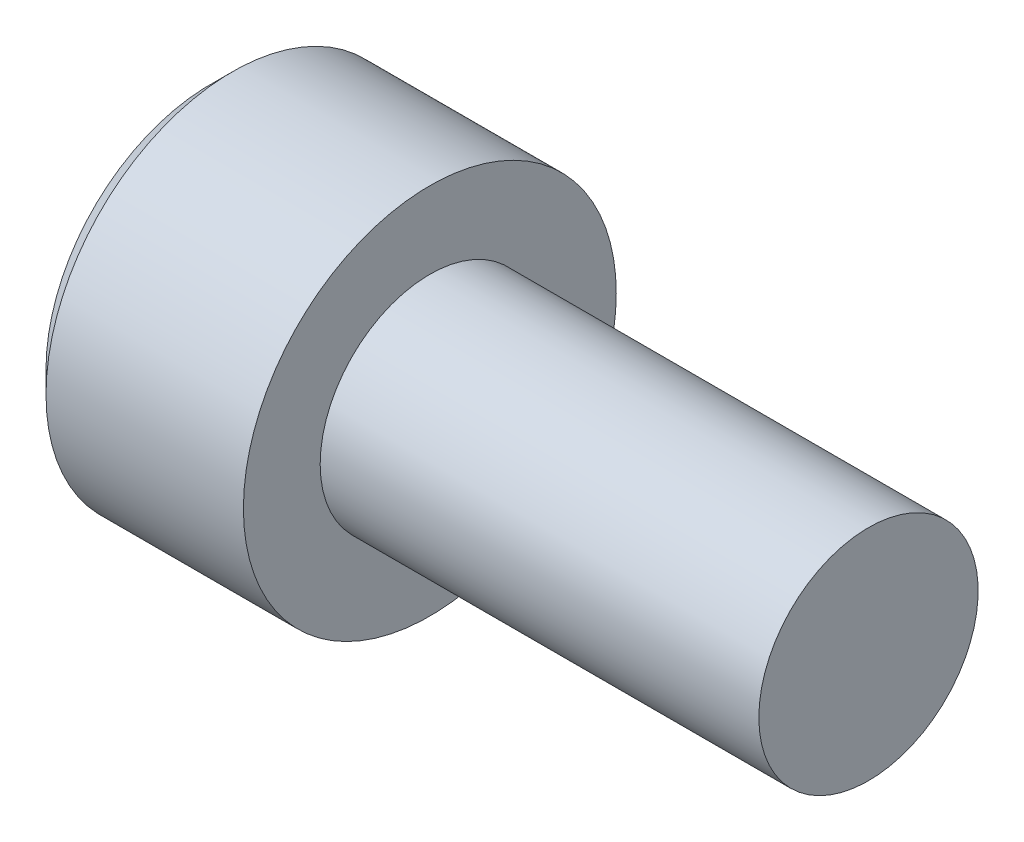
ISO-10303-21;
HEADER;
FILE_DESCRIPTION(('STEP AP214'),'2;1');
FILE_NAME('part.step','',(''),(''),'','','');
FILE_SCHEMA(('AUTOMOTIVE_DESIGN { 1 0 10303 214 1 1 1 1 }'));
ENDSEC;
DATA;
#1=APPLICATION_CONTEXT('core data for automotive mechanical design processes');
#2=APPLICATION_PROTOCOL_DEFINITION('international standard','automotive_design',2000,#1);
#3=PRODUCT_CONTEXT('',#1,'mechanical');
#4=PRODUCT('Part','Part','',(#3));
#5=PRODUCT_RELATED_PRODUCT_CATEGORY('part','',(#4));
#6=PRODUCT_DEFINITION_FORMATION('','',#4);
#7=PRODUCT_DEFINITION_CONTEXT('part definition',#1,'design');
#8=PRODUCT_DEFINITION('design','',#6,#7);
#9=PRODUCT_DEFINITION_SHAPE('','',#8);
#10=(LENGTH_UNIT() NAMED_UNIT(*) SI_UNIT(.MILLI.,.METRE.));
#11=(NAMED_UNIT(*) PLANE_ANGLE_UNIT() SI_UNIT($,.RADIAN.));
#12=(NAMED_UNIT(*) SI_UNIT($,.STERADIAN.) SOLID_ANGLE_UNIT());
#13=UNCERTAINTY_MEASURE_WITH_UNIT(LENGTH_MEASURE(1.E-05),#10,'distance_accuracy_value','');
#14=(GEOMETRIC_REPRESENTATION_CONTEXT(3) GLOBAL_UNCERTAINTY_ASSIGNED_CONTEXT((#13)) GLOBAL_UNIT_ASSIGNED_CONTEXT((#10,
#11,#12)) REPRESENTATION_CONTEXT('',''));
#15=CARTESIAN_POINT('',(0.,0.,0.));
#16=DIRECTION('',(0.,0.,1.));
#17=DIRECTION('',(1.,0.,0.));
#18=AXIS2_PLACEMENT_3D('',#15,#16,#17);
#19=CARTESIAN_POINT('',(-5.,4.25,0.));
#20=DIRECTION('',(1.,0.,0.));
#21=DIRECTION('',(0.,0.,-1.));
#22=AXIS2_PLACEMENT_3D('',#19,#20,#21);
#23=PLANE('',#22);
#24=CARTESIAN_POINT('',(-5.,0.,0.));
#25=DIRECTION('',(1.,0.,0.));
#26=DIRECTION('',(0.,0.,-1.));
#27=AXIS2_PLACEMENT_3D('',#24,#25,#26);
#28=CIRCLE('',#27,3.75);
#29=CARTESIAN_POINT('',(-5.,0.,-3.75));
#30=VERTEX_POINT('',#29);
#31=EDGE_CURVE('E47',#30,#30,#28,.F.);
#32=ORIENTED_EDGE('',*,*,#31,.T.);
#33=EDGE_LOOP('',(#32));
#34=FACE_BOUND('',#33,.T.);
#35=DIRECTION('',(0.,0.5,0.866025403784439));
#36=VECTOR('',#35,1.);
#37=CARTESIAN_POINT('',(-5.,-2.3094010767585,0.));
#38=LINE('',#37,#36);
#39=CARTESIAN_POINT('',(-5.,-2.3094010767585,0.));
#40=VERTEX_POINT('',#39);
#41=CARTESIAN_POINT('',(-5.,-1.15470053837925,2.));
#42=VERTEX_POINT('',#41);
#43=EDGE_CURVE('E154',#40,#42,#38,.T.);
#44=ORIENTED_EDGE('',*,*,#43,.F.);
#45=DIRECTION('',(0.,-0.5,0.866025403784439));
#46=VECTOR('',#45,1.);
#47=CARTESIAN_POINT('',(-5.,-1.15470053837925,-2.));
#48=LINE('',#47,#46);
#49=CARTESIAN_POINT('',(-5.,-1.15470053837925,-2.));
#50=VERTEX_POINT('',#49);
#51=EDGE_CURVE('E54',#50,#40,#48,.T.);
#52=ORIENTED_EDGE('',*,*,#51,.F.);
#53=DIRECTION('',(0.,-1.,0.));
#54=VECTOR('',#53,1.);
#55=CARTESIAN_POINT('',(-5.,1.15470053837925,-2.));
#56=LINE('',#55,#54);
#57=CARTESIAN_POINT('',(-5.,1.15470053837925,-2.));
#58=VERTEX_POINT('',#57);
#59=EDGE_CURVE('E124',#58,#50,#56,.T.);
#60=ORIENTED_EDGE('',*,*,#59,.F.);
#61=DIRECTION('',(0.,-0.5,-0.866025403784439));
#62=VECTOR('',#61,1.);
#63=CARTESIAN_POINT('',(-5.,2.3094010767585,0.));
#64=LINE('',#63,#62);
#65=CARTESIAN_POINT('',(-5.,2.3094010767585,0.));
#66=VERTEX_POINT('',#65);
#67=EDGE_CURVE('E160',#66,#58,#64,.T.);
#68=ORIENTED_EDGE('',*,*,#67,.F.);
#69=DIRECTION('',(0.,0.5,-0.866025403784439));
#70=VECTOR('',#69,1.);
#71=CARTESIAN_POINT('',(-5.,1.15470053837925,2.));
#72=LINE('',#71,#70);
#73=CARTESIAN_POINT('',(-5.,1.15470053837925,2.));
#74=VERTEX_POINT('',#73);
#75=EDGE_CURVE('E158',#74,#66,#72,.T.);
#76=ORIENTED_EDGE('',*,*,#75,.F.);
#77=DIRECTION('',(0.,1.,0.));
#78=VECTOR('',#77,1.);
#79=CARTESIAN_POINT('',(-5.,-1.15470053837925,2.));
#80=LINE('',#79,#78);
#81=EDGE_CURVE('E156',#42,#74,#80,.T.);
#82=ORIENTED_EDGE('',*,*,#81,.F.);
#83=EDGE_LOOP('',(#44,#52,#60,#68,#76,#82));
#84=FACE_BOUND('',#83,.T.);
#85=ADVANCED_FACE('F39',(#34,#84),#23,.F.);
#86=CARTESIAN_POINT('',(10.,0.,0.));
#87=DIRECTION('',(-1.,0.,0.));
#88=DIRECTION('',(0.,0.,1.));
#89=AXIS2_PLACEMENT_3D('',#86,#87,#88);
#90=PLANE('',#89);
#91=CARTESIAN_POINT('',(10.,0.,0.));
#92=DIRECTION('',(-1.,0.,0.));
#93=DIRECTION('',(0.,0.,1.));
#94=AXIS2_PLACEMENT_3D('',#91,#92,#93);
#95=CIRCLE('',#94,2.5);
#96=CARTESIAN_POINT('',(10.,0.,2.5));
#97=VERTEX_POINT('',#96);
#98=EDGE_CURVE('E186',#97,#97,#95,.T.);
#99=ORIENTED_EDGE('',*,*,#98,.F.);
#100=EDGE_LOOP('',(#99));
#101=FACE_BOUND('',#100,.T.);
#102=ADVANCED_FACE('F207',(#101),#90,.F.);
#103=CARTESIAN_POINT('',(-5.,0.,0.));
#104=DIRECTION('',(-1.,0.,0.));
#105=DIRECTION('',(0.,0.,1.));
#106=AXIS2_PLACEMENT_3D('',#103,#104,#105);
#107=CYLINDRICAL_SURFACE('',#106,2.5);
#108=CARTESIAN_POINT('',(0.,0.,0.));
#109=DIRECTION('',(-1.,0.,0.));
#110=DIRECTION('',(0.,0.,1.));
#111=AXIS2_PLACEMENT_3D('',#108,#109,#110);
#112=CIRCLE('',#111,2.5);
#113=CARTESIAN_POINT('',(0.,0.,2.5));
#114=VERTEX_POINT('',#113);
#115=EDGE_CURVE('E183',#114,#114,#112,.T.);
#116=ORIENTED_EDGE('',*,*,#115,.F.);
#117=EDGE_LOOP('',(#116));
#118=FACE_BOUND('',#117,.T.);
#119=ORIENTED_EDGE('',*,*,#98,.T.);
#120=EDGE_LOOP('',(#119));
#121=FACE_BOUND('',#120,.T.);
#122=ADVANCED_FACE('F211',(#118,#121),#107,.T.);
#123=CARTESIAN_POINT('',(0.,2.5,0.));
#124=DIRECTION('',(-1.,0.,0.));
#125=DIRECTION('',(0.,0.,1.));
#126=AXIS2_PLACEMENT_3D('',#123,#124,#125);
#127=PLANE('',#126);
#128=CARTESIAN_POINT('',(0.,0.,0.));
#129=DIRECTION('',(-1.,0.,0.));
#130=DIRECTION('',(0.,0.,1.));
#131=AXIS2_PLACEMENT_3D('',#128,#129,#130);
#132=CIRCLE('',#131,4.25);
#133=CARTESIAN_POINT('',(0.,0.,4.25));
#134=VERTEX_POINT('',#133);
#135=EDGE_CURVE('E179',#134,#134,#132,.T.);
#136=ORIENTED_EDGE('',*,*,#135,.F.);
#137=EDGE_LOOP('',(#136));
#138=FACE_BOUND('',#137,.T.);
#139=ORIENTED_EDGE('',*,*,#115,.T.);
#140=EDGE_LOOP('',(#139));
#141=FACE_BOUND('',#140,.T.);
#142=ADVANCED_FACE('F202',(#138,#141),#127,.F.);
#143=CARTESIAN_POINT('',(-5.,0.,0.));
#144=DIRECTION('',(-1.,0.,0.));
#145=DIRECTION('',(0.,0.,1.));
#146=AXIS2_PLACEMENT_3D('',#143,#144,#145);
#147=CYLINDRICAL_SURFACE('',#146,4.25);
#148=CARTESIAN_POINT('',(-4.49999999999999,0.,0.));
#149=DIRECTION('',(1.,0.,0.));
#150=DIRECTION('',(0.,0.,-1.));
#151=AXIS2_PLACEMENT_3D('',#148,#149,#150);
#152=CIRCLE('',#151,4.25);
#153=CARTESIAN_POINT('',(-4.49999999999999,0.,-4.25));
#154=VERTEX_POINT('',#153);
#155=EDGE_CURVE('E11',#154,#154,#152,.T.);
#156=ORIENTED_EDGE('',*,*,#155,.T.);
#157=EDGE_LOOP('',(#156));
#158=FACE_BOUND('',#157,.T.);
#159=ORIENTED_EDGE('',*,*,#135,.T.);
#160=EDGE_LOOP('',(#159));
#161=FACE_BOUND('',#160,.T.);
#162=ADVANCED_FACE('F194',(#158,#161),#147,.T.);
#163=CARTESIAN_POINT('',(-5.,0.,0.));
#164=DIRECTION('',(1.,0.,0.));
#165=DIRECTION('',(0.,0.,-1.));
#166=AXIS2_PLACEMENT_3D('',#163,#164,#165);
#167=CONICAL_SURFACE('',#166,3.75,0.785398163397444);
#168=ORIENTED_EDGE('',*,*,#155,.F.);
#169=EDGE_LOOP('',(#168));
#170=FACE_BOUND('',#169,.T.);
#171=ORIENTED_EDGE('',*,*,#31,.F.);
#172=EDGE_LOOP('',(#171));
#173=FACE_BOUND('',#172,.T.);
#174=ADVANCED_FACE('F41',(#170,#173),#167,.T.);
#175=CARTESIAN_POINT('',(-2.5,-1.15470053837925,-2.));
#176=DIRECTION('',(0.,-0.866025403784439,-0.5));
#177=DIRECTION('',(0.,0.5,-0.866025403784439));
#178=AXIS2_PLACEMENT_3D('',#175,#176,#177);
#179=PLANE('',#178);
#180=DIRECTION('',(0.,-0.5,0.866025403784439));
#181=VECTOR('',#180,1.);
#182=CARTESIAN_POINT('',(-2.5,-1.15470053837925,-2.));
#183=LINE('',#182,#181);
#184=CARTESIAN_POINT('',(-2.5,-1.15470053837925,-2.));
#185=VERTEX_POINT('',#184);
#186=CARTESIAN_POINT('',(-2.5,-1.73205080756888,-0.999999999999999));
#187=VERTEX_POINT('',#186);
#188=EDGE_CURVE('E123',#185,#187,#183,.T.);
#189=ORIENTED_EDGE('',*,*,#188,.F.);
#190=DIRECTION('',(-1.,0.,0.));
#191=VECTOR('',#190,1.);
#192=CARTESIAN_POINT('',(-2.5,-1.15470053837925,-2.));
#193=LINE('',#192,#191);
#194=EDGE_CURVE('E163',#185,#50,#193,.T.);
#195=ORIENTED_EDGE('',*,*,#194,.T.);
#196=ORIENTED_EDGE('',*,*,#51,.T.);
#197=DIRECTION('',(-1.,0.,0.));
#198=VECTOR('',#197,1.);
#199=CARTESIAN_POINT('',(-2.5,-2.3094010767585,0.));
#200=LINE('',#199,#198);
#201=CARTESIAN_POINT('',(-2.5,-2.3094010767585,0.));
#202=VERTEX_POINT('',#201);
#203=EDGE_CURVE('E126',#202,#40,#200,.T.);
#204=ORIENTED_EDGE('',*,*,#203,.F.);
#205=EDGE_CURVE('E115',#187,#202,#183,.T.);
#206=ORIENTED_EDGE('',*,*,#205,.F.);
#207=EDGE_LOOP('',(#189,#195,#196,#204,#206));
#208=FACE_BOUND('',#207,.T.);
#209=ADVANCED_FACE('F127',(#208),#179,.F.);
#210=CARTESIAN_POINT('',(-2.5,1.15470053837925,-2.));
#211=DIRECTION('',(0.,0.,-1.));
#212=DIRECTION('',(-1.,0.,0.));
#213=AXIS2_PLACEMENT_3D('',#210,#211,#212);
#214=PLANE('',#213);
#215=DIRECTION('',(0.,-1.,0.));
#216=VECTOR('',#215,1.);
#217=CARTESIAN_POINT('',(-2.5,1.15470053837925,-2.));
#218=LINE('',#217,#216);
#219=CARTESIAN_POINT('',(-2.5,1.15470053837925,-2.));
#220=VERTEX_POINT('',#219);
#221=CARTESIAN_POINT('',(-2.5,0.,-2.));
#222=VERTEX_POINT('',#221);
#223=EDGE_CURVE('E132',#220,#222,#218,.T.);
#224=ORIENTED_EDGE('',*,*,#223,.F.);
#225=DIRECTION('',(-1.,0.,0.));
#226=VECTOR('',#225,1.);
#227=CARTESIAN_POINT('',(-2.5,1.15470053837925,-2.));
#228=LINE('',#227,#226);
#229=EDGE_CURVE('E165',#220,#58,#228,.T.);
#230=ORIENTED_EDGE('',*,*,#229,.T.);
#231=ORIENTED_EDGE('',*,*,#59,.T.);
#232=ORIENTED_EDGE('',*,*,#194,.F.);
#233=EDGE_CURVE('E150',#222,#185,#218,.T.);
#234=ORIENTED_EDGE('',*,*,#233,.F.);
#235=EDGE_LOOP('',(#224,#230,#231,#232,#234));
#236=FACE_BOUND('',#235,.T.);
#237=ADVANCED_FACE('F200',(#236),#214,.F.);
#238=CARTESIAN_POINT('',(-2.5,2.3094010767585,0.));
#239=DIRECTION('',(0.,0.866025403784439,-0.5));
#240=DIRECTION('',(0.,0.5,0.866025403784439));
#241=AXIS2_PLACEMENT_3D('',#238,#239,#240);
#242=PLANE('',#241);
#243=DIRECTION('',(0.,-0.5,-0.866025403784439));
#244=VECTOR('',#243,1.);
#245=CARTESIAN_POINT('',(-2.5,2.3094010767585,0.));
#246=LINE('',#245,#244);
#247=CARTESIAN_POINT('',(-2.5,2.3094010767585,0.));
#248=VERTEX_POINT('',#247);
#249=CARTESIAN_POINT('',(-2.5,1.73205080756888,-1.));
#250=VERTEX_POINT('',#249);
#251=EDGE_CURVE('E147',#248,#250,#246,.T.);
#252=ORIENTED_EDGE('',*,*,#251,.F.);
#253=DIRECTION('',(-1.,0.,0.));
#254=VECTOR('',#253,1.);
#255=CARTESIAN_POINT('',(-2.5,2.3094010767585,0.));
#256=LINE('',#255,#254);
#257=EDGE_CURVE('E168',#248,#66,#256,.T.);
#258=ORIENTED_EDGE('',*,*,#257,.T.);
#259=ORIENTED_EDGE('',*,*,#67,.T.);
#260=ORIENTED_EDGE('',*,*,#229,.F.);
#261=EDGE_CURVE('E146',#250,#220,#246,.T.);
#262=ORIENTED_EDGE('',*,*,#261,.F.);
#263=EDGE_LOOP('',(#252,#258,#259,#260,#262));
#264=FACE_BOUND('',#263,.T.);
#265=ADVANCED_FACE('F236',(#264),#242,.F.);
#266=CARTESIAN_POINT('',(-2.5,1.15470053837925,2.));
#267=DIRECTION('',(0.,0.866025403784439,0.5));
#268=DIRECTION('',(0.,-0.5,0.866025403784439));
#269=AXIS2_PLACEMENT_3D('',#266,#267,#268);
#270=PLANE('',#269);
#271=DIRECTION('',(0.,0.5,-0.866025403784439));
#272=VECTOR('',#271,1.);
#273=CARTESIAN_POINT('',(-2.5,1.15470053837925,2.));
#274=LINE('',#273,#272);
#275=CARTESIAN_POINT('',(-2.5,1.15470053837925,2.));
#276=VERTEX_POINT('',#275);
#277=CARTESIAN_POINT('',(-2.5,1.73205080756888,0.999999999999999));
#278=VERTEX_POINT('',#277);
#279=EDGE_CURVE('E143',#276,#278,#274,.T.);
#280=ORIENTED_EDGE('',*,*,#279,.F.);
#281=DIRECTION('',(-1.,0.,0.));
#282=VECTOR('',#281,1.);
#283=CARTESIAN_POINT('',(-2.5,1.15470053837925,2.));
#284=LINE('',#283,#282);
#285=EDGE_CURVE('E171',#276,#74,#284,.T.);
#286=ORIENTED_EDGE('',*,*,#285,.T.);
#287=ORIENTED_EDGE('',*,*,#75,.T.);
#288=ORIENTED_EDGE('',*,*,#257,.F.);
#289=EDGE_CURVE('E142',#278,#248,#274,.T.);
#290=ORIENTED_EDGE('',*,*,#289,.F.);
#291=EDGE_LOOP('',(#280,#286,#287,#288,#290));
#292=FACE_BOUND('',#291,.T.);
#293=ADVANCED_FACE('F232',(#292),#270,.F.);
#294=CARTESIAN_POINT('',(-2.5,-1.15470053837925,2.));
#295=DIRECTION('',(0.,0.,1.));
#296=DIRECTION('',(0.,-1.,0.));
#297=AXIS2_PLACEMENT_3D('',#294,#295,#296);
#298=PLANE('',#297);
#299=DIRECTION('',(0.,1.,0.));
#300=VECTOR('',#299,1.);
#301=CARTESIAN_POINT('',(-2.5,-1.15470053837925,2.));
#302=LINE('',#301,#300);
#303=CARTESIAN_POINT('',(-2.5,-1.15470053837925,2.));
#304=VERTEX_POINT('',#303);
#305=CARTESIAN_POINT('',(-2.5,0.,2.));
#306=VERTEX_POINT('',#305);
#307=EDGE_CURVE('E62',#304,#306,#302,.T.);
#308=ORIENTED_EDGE('',*,*,#307,.F.);
#309=DIRECTION('',(-1.,0.,0.));
#310=VECTOR('',#309,1.);
#311=CARTESIAN_POINT('',(-2.5,-1.15470053837925,2.));
#312=LINE('',#311,#310);
#313=EDGE_CURVE('E131',#304,#42,#312,.T.);
#314=ORIENTED_EDGE('',*,*,#313,.T.);
#315=ORIENTED_EDGE('',*,*,#81,.T.);
#316=ORIENTED_EDGE('',*,*,#285,.F.);
#317=EDGE_CURVE('E138',#306,#276,#302,.T.);
#318=ORIENTED_EDGE('',*,*,#317,.F.);
#319=EDGE_LOOP('',(#308,#314,#315,#316,#318));
#320=FACE_BOUND('',#319,.T.);
#321=ADVANCED_FACE('F229',(#320),#298,.F.);
#322=CARTESIAN_POINT('',(-2.5,-2.3094010767585,0.));
#323=DIRECTION('',(0.,-0.866025403784439,0.5));
#324=DIRECTION('',(0.,-0.5,-0.866025403784439));
#325=AXIS2_PLACEMENT_3D('',#322,#323,#324);
#326=PLANE('',#325);
#327=DIRECTION('',(0.,0.5,0.866025403784439));
#328=VECTOR('',#327,1.);
#329=CARTESIAN_POINT('',(-2.5,-2.3094010767585,0.));
#330=LINE('',#329,#328);
#331=CARTESIAN_POINT('',(-2.5,-1.73205080756888,1.));
#332=VERTEX_POINT('',#331);
#333=EDGE_CURVE('E118',#202,#332,#330,.T.);
#334=ORIENTED_EDGE('',*,*,#333,.F.);
#335=ORIENTED_EDGE('',*,*,#203,.T.);
#336=ORIENTED_EDGE('',*,*,#43,.T.);
#337=ORIENTED_EDGE('',*,*,#313,.F.);
#338=EDGE_CURVE('E137',#332,#304,#330,.T.);
#339=ORIENTED_EDGE('',*,*,#338,.F.);
#340=EDGE_LOOP('',(#334,#335,#336,#337,#339));
#341=FACE_BOUND('',#340,.T.);
#342=ADVANCED_FACE('F135',(#341),#326,.F.);
#343=CARTESIAN_POINT('',(-2.5,0.,0.));
#344=DIRECTION('',(-1.,0.,0.));
#345=DIRECTION('',(0.,0.,1.));
#346=AXIS2_PLACEMENT_3D('',#343,#344,#345);
#347=PLANE('',#346);
#348=ORIENTED_EDGE('',*,*,#317,.T.);
#349=ORIENTED_EDGE('',*,*,#279,.T.);
#350=CARTESIAN_POINT('',(-2.5,0.,0.));
#351=DIRECTION('',(-1.,0.,0.));
#352=DIRECTION('',(0.,-1.,0.));
#353=AXIS2_PLACEMENT_3D('',#350,#351,#352);
#354=CIRCLE('',#353,2.);
#355=EDGE_CURVE('E180',#306,#278,#354,.T.);
#356=ORIENTED_EDGE('',*,*,#355,.F.);
#357=EDGE_LOOP('',(#348,#349,#356));
#358=FACE_BOUND('',#357,.T.);
#359=ADVANCED_FACE('F228',(#358),#347,.T.);
#360=ORIENTED_EDGE('',*,*,#289,.T.);
#361=ORIENTED_EDGE('',*,*,#251,.T.);
#362=EDGE_CURVE('E266',#278,#250,#354,.T.);
#363=ORIENTED_EDGE('',*,*,#362,.F.);
#364=EDGE_LOOP('',(#360,#361,#363));
#365=FACE_BOUND('',#364,.T.);
#366=ADVANCED_FACE('F250',(#365),#347,.T.);
#367=ORIENTED_EDGE('',*,*,#261,.T.);
#368=ORIENTED_EDGE('',*,*,#223,.T.);
#369=EDGE_CURVE('E268',#250,#222,#354,.T.);
#370=ORIENTED_EDGE('',*,*,#369,.F.);
#371=EDGE_LOOP('',(#367,#368,#370));
#372=FACE_BOUND('',#371,.T.);
#373=ADVANCED_FACE('F255',(#372),#347,.T.);
#374=ORIENTED_EDGE('',*,*,#233,.T.);
#375=ORIENTED_EDGE('',*,*,#188,.T.);
#376=EDGE_CURVE('E269',#222,#187,#354,.T.);
#377=ORIENTED_EDGE('',*,*,#376,.F.);
#378=EDGE_LOOP('',(#374,#375,#377));
#379=FACE_BOUND('',#378,.T.);
#380=ADVANCED_FACE('F248',(#379),#347,.T.);
#381=ORIENTED_EDGE('',*,*,#205,.T.);
#382=ORIENTED_EDGE('',*,*,#333,.T.);
#383=EDGE_CURVE('E120',#187,#332,#354,.T.);
#384=ORIENTED_EDGE('',*,*,#383,.F.);
#385=EDGE_LOOP('',(#381,#382,#384));
#386=FACE_BOUND('',#385,.T.);
#387=ADVANCED_FACE('F116',(#386),#347,.T.);
#388=ORIENTED_EDGE('',*,*,#338,.T.);
#389=ORIENTED_EDGE('',*,*,#307,.T.);
#390=EDGE_CURVE('E176',#332,#306,#354,.T.);
#391=ORIENTED_EDGE('',*,*,#390,.F.);
#392=EDGE_LOOP('',(#388,#389,#391));
#393=FACE_BOUND('',#392,.T.);
#394=ADVANCED_FACE('F223',(#393),#347,.T.);
#395=CARTESIAN_POINT('',(-1.29827876194487,0.,0.));
#396=DIRECTION('',(-1.,0.,0.));
#397=DIRECTION('',(0.,-1.,0.));
#398=AXIS2_PLACEMENT_3D('',#395,#396,#397);
#399=CONICAL_SURFACE('',#398,0.,1.02974425867665);
#400=ORIENTED_EDGE('',*,*,#390,.T.);
#401=ORIENTED_EDGE('',*,*,#355,.T.);
#402=ORIENTED_EDGE('',*,*,#362,.T.);
#403=ORIENTED_EDGE('',*,*,#369,.T.);
#404=ORIENTED_EDGE('',*,*,#376,.T.);
#405=ORIENTED_EDGE('',*,*,#383,.T.);
#406=EDGE_LOOP('',(#400,#401,#402,#403,#404,#405));
#407=FACE_BOUND('',#406,.T.);
#408=CARTESIAN_POINT('',(-1.29827876194487,0.,0.));
#409=VERTEX_POINT('',#408);
#410=VERTEX_LOOP('',#409);
#411=FACE_BOUND('',#410,.T.);
#412=ADVANCED_FACE('F221',(#407,#411),#399,.F.);
#413=CLOSED_SHELL('',(#85,#102,#122,#142,#162,#174,#209,#237,#265,#293,#321,#342,#359,#366,#373,
#380,#387,#394,#412));
#414=MANIFOLD_SOLID_BREP('B2',#413);
#415=ADVANCED_BREP_SHAPE_REPRESENTATION('',(#18,#414),#14);
#416=SHAPE_DEFINITION_REPRESENTATION(#9,#415);
ENDSEC;
END-ISO-10303-21;
